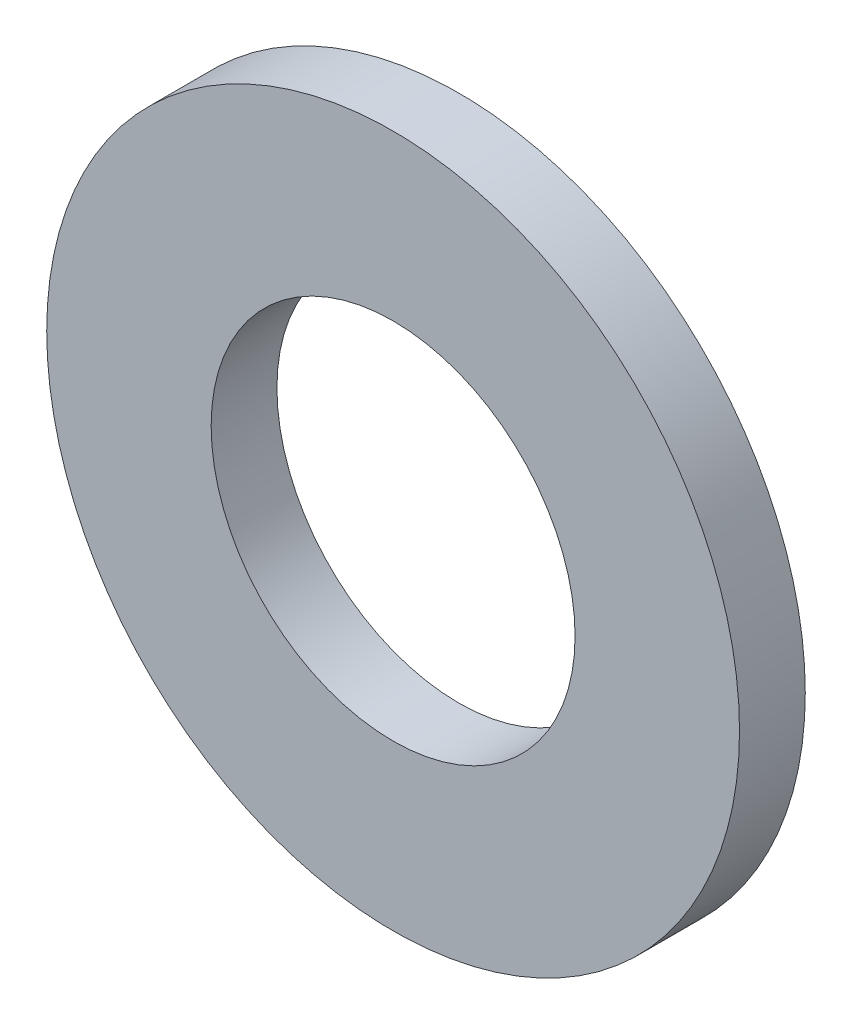
ISO-10303-21;
HEADER;
FILE_DESCRIPTION(('STEP AP214'),'2;1');
FILE_NAME('part.step','',(''),(''),'','','');
FILE_SCHEMA(('AUTOMOTIVE_DESIGN { 1 0 10303 214 1 1 1 1 }'));
ENDSEC;
DATA;
#1=APPLICATION_CONTEXT('core data for automotive mechanical design processes');
#2=APPLICATION_PROTOCOL_DEFINITION('international standard','automotive_design',2000,#1);
#3=PRODUCT_CONTEXT('',#1,'mechanical');
#4=PRODUCT('Part','Part','',(#3));
#5=PRODUCT_RELATED_PRODUCT_CATEGORY('part','',(#4));
#6=PRODUCT_DEFINITION_FORMATION('','',#4);
#7=PRODUCT_DEFINITION_CONTEXT('part definition',#1,'design');
#8=PRODUCT_DEFINITION('design','',#6,#7);
#9=PRODUCT_DEFINITION_SHAPE('','',#8);
#10=(LENGTH_UNIT() NAMED_UNIT(*) SI_UNIT(.MILLI.,.METRE.));
#11=(NAMED_UNIT(*) PLANE_ANGLE_UNIT() SI_UNIT($,.RADIAN.));
#12=(NAMED_UNIT(*) SI_UNIT($,.STERADIAN.) SOLID_ANGLE_UNIT());
#13=UNCERTAINTY_MEASURE_WITH_UNIT(LENGTH_MEASURE(1.E-05),#10,'distance_accuracy_value','');
#14=(GEOMETRIC_REPRESENTATION_CONTEXT(3) GLOBAL_UNCERTAINTY_ASSIGNED_CONTEXT((#13)) GLOBAL_UNIT_ASSIGNED_CONTEXT((#10,
#11,#12)) REPRESENTATION_CONTEXT('',''));
#15=CARTESIAN_POINT('',(0.,0.,0.));
#16=DIRECTION('',(0.,0.,1.));
#17=DIRECTION('',(1.,0.,0.));
#18=AXIS2_PLACEMENT_3D('',#15,#16,#17);
#19=CARTESIAN_POINT('',(0.,0.,1.5));
#20=DIRECTION('',(0.,0.,1.));
#21=DIRECTION('',(1.,0.,0.));
#22=AXIS2_PLACEMENT_3D('',#19,#20,#21);
#23=PLANE('',#22);
#24=CARTESIAN_POINT('',(0.,0.,1.5));
#25=DIRECTION('',(0.,0.,1.));
#26=DIRECTION('',(1.,0.,0.));
#27=AXIS2_PLACEMENT_3D('',#24,#25,#26);
#28=CIRCLE('',#27,7.9);
#29=CARTESIAN_POINT('',(7.9,0.,1.5));
#30=VERTEX_POINT('',#29);
#31=EDGE_CURVE('E10',#30,#30,#28,.T.);
#32=ORIENTED_EDGE('',*,*,#31,.T.);
#33=EDGE_LOOP('',(#32));
#34=FACE_BOUND('',#33,.T.);
#35=CARTESIAN_POINT('',(0.,0.,1.5));
#36=DIRECTION('',(0.,0.,1.));
#37=DIRECTION('',(1.,0.,0.));
#38=AXIS2_PLACEMENT_3D('',#35,#36,#37);
#39=CIRCLE('',#38,4.15);
#40=CARTESIAN_POINT('',(4.15,0.,1.5));
#41=VERTEX_POINT('',#40);
#42=EDGE_CURVE('E44',#41,#41,#39,.T.);
#43=ORIENTED_EDGE('',*,*,#42,.F.);
#44=EDGE_LOOP('',(#43));
#45=FACE_BOUND('',#44,.T.);
#46=ADVANCED_FACE('F33',(#34,#45),#23,.T.);
#47=CARTESIAN_POINT('',(0.,0.,0.));
#48=DIRECTION('',(0.,0.,1.));
#49=DIRECTION('',(1.,0.,0.));
#50=AXIS2_PLACEMENT_3D('',#47,#48,#49);
#51=PLANE('',#50);
#52=CARTESIAN_POINT('',(0.,0.,0.));
#53=DIRECTION('',(0.,0.,1.));
#54=DIRECTION('',(1.,0.,0.));
#55=AXIS2_PLACEMENT_3D('',#52,#53,#54);
#56=CIRCLE('',#55,7.9);
#57=CARTESIAN_POINT('',(7.9,0.,0.));
#58=VERTEX_POINT('',#57);
#59=EDGE_CURVE('E37',#58,#58,#56,.T.);
#60=ORIENTED_EDGE('',*,*,#59,.F.);
#61=EDGE_LOOP('',(#60));
#62=FACE_BOUND('',#61,.T.);
#63=CARTESIAN_POINT('',(0.,0.,0.));
#64=DIRECTION('',(0.,0.,1.));
#65=DIRECTION('',(1.,0.,0.));
#66=AXIS2_PLACEMENT_3D('',#63,#64,#65);
#67=CIRCLE('',#66,4.15);
#68=CARTESIAN_POINT('',(4.15,0.,0.));
#69=VERTEX_POINT('',#68);
#70=EDGE_CURVE('E46',#69,#69,#67,.T.);
#71=ORIENTED_EDGE('',*,*,#70,.T.);
#72=EDGE_LOOP('',(#71));
#73=FACE_BOUND('',#72,.T.);
#74=ADVANCED_FACE('F56',(#62,#73),#51,.F.);
#75=CARTESIAN_POINT('',(0.,0.,1.5));
#76=DIRECTION('',(0.,0.,-1.));
#77=DIRECTION('',(-1.,0.,0.));
#78=AXIS2_PLACEMENT_3D('',#75,#76,#77);
#79=CYLINDRICAL_SURFACE('',#78,7.9);
#80=ORIENTED_EDGE('',*,*,#31,.F.);
#81=EDGE_LOOP('',(#80));
#82=FACE_BOUND('',#81,.T.);
#83=ORIENTED_EDGE('',*,*,#59,.T.);
#84=EDGE_LOOP('',(#83));
#85=FACE_BOUND('',#84,.T.);
#86=ADVANCED_FACE('F35',(#82,#85),#79,.T.);
#87=CARTESIAN_POINT('',(0.,0.,1.5));
#88=DIRECTION('',(0.,0.,-1.));
#89=DIRECTION('',(-1.,0.,0.));
#90=AXIS2_PLACEMENT_3D('',#87,#88,#89);
#91=CYLINDRICAL_SURFACE('',#90,4.15);
#92=ORIENTED_EDGE('',*,*,#42,.T.);
#93=EDGE_LOOP('',(#92));
#94=FACE_BOUND('',#93,.T.);
#95=ORIENTED_EDGE('',*,*,#70,.F.);
#96=EDGE_LOOP('',(#95));
#97=FACE_BOUND('',#96,.T.);
#98=ADVANCED_FACE('F52',(#94,#97),#91,.F.);
#99=CLOSED_SHELL('',(#46,#74,#86,#98));
#100=MANIFOLD_SOLID_BREP('B2',#99);
#101=ADVANCED_BREP_SHAPE_REPRESENTATION('',(#18,#100),#14);
#102=SHAPE_DEFINITION_REPRESENTATION(#9,#101);
ENDSEC;
END-ISO-10303-21;
